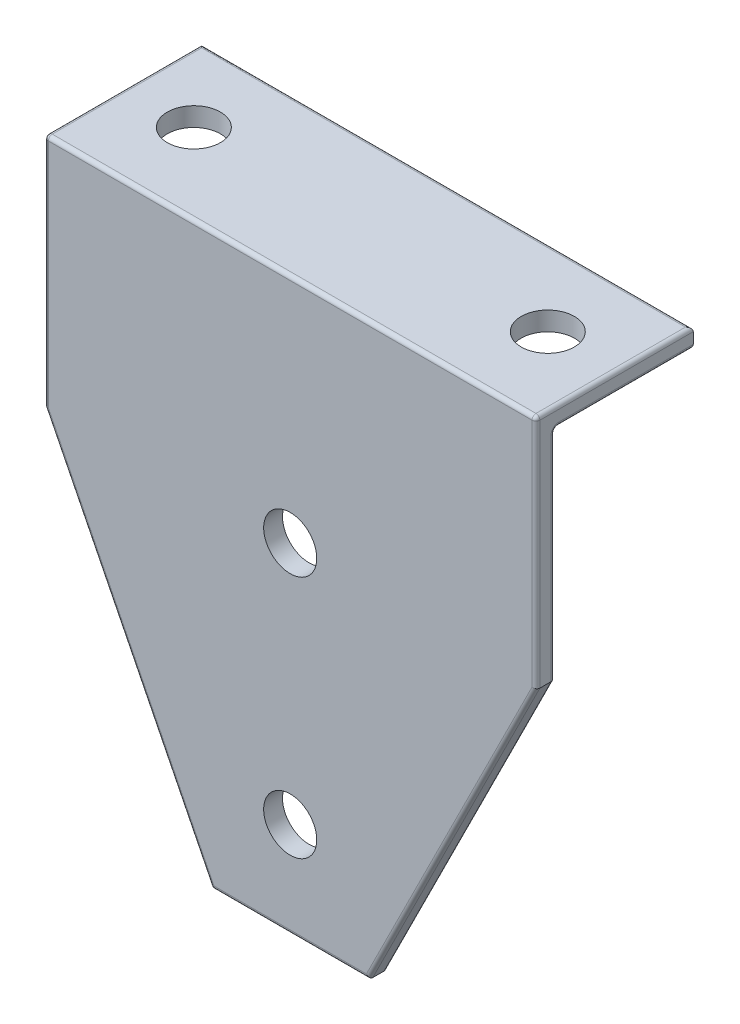
ISO-10303-21;
HEADER;
FILE_DESCRIPTION(('STEP AP214'),'2;1');
FILE_NAME('part.step','',(''),(''),'','','');
FILE_SCHEMA(('AUTOMOTIVE_DESIGN { 1 0 10303 214 1 1 1 1 }'));
ENDSEC;
DATA;
#1=APPLICATION_CONTEXT('core data for automotive mechanical design processes');
#2=APPLICATION_PROTOCOL_DEFINITION('international standard','automotive_design',2000,#1);
#3=PRODUCT_CONTEXT('',#1,'mechanical');
#4=PRODUCT('Part','Part','',(#3));
#5=PRODUCT_RELATED_PRODUCT_CATEGORY('part','',(#4));
#6=PRODUCT_DEFINITION_FORMATION('','',#4);
#7=PRODUCT_DEFINITION_CONTEXT('part definition',#1,'design');
#8=PRODUCT_DEFINITION('design','',#6,#7);
#9=PRODUCT_DEFINITION_SHAPE('','',#8);
#10=(LENGTH_UNIT() NAMED_UNIT(*) SI_UNIT(.MILLI.,.METRE.));
#11=(NAMED_UNIT(*) PLANE_ANGLE_UNIT() SI_UNIT($,.RADIAN.));
#12=(NAMED_UNIT(*) SI_UNIT($,.STERADIAN.) SOLID_ANGLE_UNIT());
#13=UNCERTAINTY_MEASURE_WITH_UNIT(LENGTH_MEASURE(1.E-05),#10,'distance_accuracy_value','');
#14=(GEOMETRIC_REPRESENTATION_CONTEXT(3) GLOBAL_UNCERTAINTY_ASSIGNED_CONTEXT((#13)) GLOBAL_UNIT_ASSIGNED_CONTEXT((#10,
#11,#12)) REPRESENTATION_CONTEXT('',''));
#15=CARTESIAN_POINT('',(0.,0.,0.));
#16=DIRECTION('',(0.,0.,1.));
#17=DIRECTION('',(1.,0.,0.));
#18=AXIS2_PLACEMENT_3D('',#15,#16,#17);
#19=CARTESIAN_POINT('',(-830.,-208.600000000002,-4.8));
#20=DIRECTION('',(0.894427190999915,-0.447213595499959,0.));
#21=DIRECTION('',(0.447213595499959,0.894427190999916,0.));
#22=AXIS2_PLACEMENT_3D('',#19,#20,#21);
#23=PLANE('',#22);
#24=DIRECTION('',(0.,0.,1.));
#25=VECTOR('',#24,1.);
#26=CARTESIAN_POINT('',(-787.5,-123.600000000001,-4.8));
#27=LINE('',#26,#25);
#28=CARTESIAN_POINT('',(-787.5,-123.600000000001,-3.8));
#29=VERTEX_POINT('',#28);
#30=CARTESIAN_POINT('',(-787.5,-123.600000000001,-1.));
#31=VERTEX_POINT('',#30);
#32=EDGE_CURVE('E355',#29,#31,#27,.T.);
#33=ORIENTED_EDGE('',*,*,#32,.T.);
#34=DIRECTION('',(0.447213595499959,0.894427190999916,0.));
#35=VECTOR('',#34,1.);
#36=CARTESIAN_POINT('',(-830.,-208.600000000002,-1.));
#37=LINE('',#36,#35);
#38=CARTESIAN_POINT('',(-830.,-208.600000000002,-1.));
#39=VERTEX_POINT('',#38);
#40=EDGE_CURVE('E271',#31,#39,#37,.F.);
#41=ORIENTED_EDGE('',*,*,#40,.T.);
#42=DIRECTION('',(0.,0.,1.));
#43=VECTOR('',#42,1.);
#44=CARTESIAN_POINT('',(-830.,-208.600000000002,-4.8));
#45=LINE('',#44,#43);
#46=CARTESIAN_POINT('',(-830.,-208.600000000002,-3.8));
#47=VERTEX_POINT('',#46);
#48=EDGE_CURVE('E204',#47,#39,#45,.T.);
#49=ORIENTED_EDGE('',*,*,#48,.F.);
#50=DIRECTION('',(0.447213595499959,0.894427190999916,0.));
#51=VECTOR('',#50,1.);
#52=CARTESIAN_POINT('',(-830.,-208.600000000002,-3.8));
#53=LINE('',#52,#51);
#54=EDGE_CURVE('E269',#47,#29,#53,.T.);
#55=ORIENTED_EDGE('',*,*,#54,.T.);
#56=EDGE_LOOP('',(#33,#41,#49,#55));
#57=FACE_BOUND('',#56,.T.);
#58=ADVANCED_FACE('F43',(#57),#23,.T.);
#59=CARTESIAN_POINT('',(-870.,-208.600000000002,-4.8));
#60=DIRECTION('',(0.,-1.,0.));
#61=DIRECTION('',(0.,0.,-1.));
#62=AXIS2_PLACEMENT_3D('',#59,#60,#61);
#63=PLANE('',#62);
#64=ORIENTED_EDGE('',*,*,#48,.T.);
#65=DIRECTION('',(1.,0.,0.));
#66=VECTOR('',#65,1.);
#67=CARTESIAN_POINT('',(-870.,-208.600000000002,-1.));
#68=LINE('',#67,#66);
#69=CARTESIAN_POINT('',(-870.,-208.600000000002,-1.));
#70=VERTEX_POINT('',#69);
#71=EDGE_CURVE('E263',#39,#70,#68,.F.);
#72=ORIENTED_EDGE('',*,*,#71,.T.);
#73=DIRECTION('',(0.,0.,1.));
#74=VECTOR('',#73,1.);
#75=CARTESIAN_POINT('',(-870.,-208.600000000002,-4.8));
#76=LINE('',#75,#74);
#77=CARTESIAN_POINT('',(-870.,-208.600000000002,-3.8));
#78=VERTEX_POINT('',#77);
#79=EDGE_CURVE('E358',#78,#70,#76,.T.);
#80=ORIENTED_EDGE('',*,*,#79,.F.);
#81=DIRECTION('',(1.,0.,0.));
#82=VECTOR('',#81,1.);
#83=CARTESIAN_POINT('',(-870.,-208.600000000002,-3.8));
#84=LINE('',#83,#82);
#85=EDGE_CURVE('E261',#78,#47,#84,.T.);
#86=ORIENTED_EDGE('',*,*,#85,.T.);
#87=EDGE_LOOP('',(#64,#72,#80,#86));
#88=FACE_BOUND('',#87,.T.);
#89=ADVANCED_FACE('F441',(#88),#63,.T.);
#90=CARTESIAN_POINT('',(-912.5,-123.600000000001,-4.8));
#91=DIRECTION('',(-0.894427190999915,-0.447213595499959,0.));
#92=DIRECTION('',(0.447213595499959,-0.894427190999916,0.));
#93=AXIS2_PLACEMENT_3D('',#90,#91,#92);
#94=PLANE('',#93);
#95=ORIENTED_EDGE('',*,*,#79,.T.);
#96=DIRECTION('',(0.447213595499959,-0.894427190999916,0.));
#97=VECTOR('',#96,1.);
#98=CARTESIAN_POINT('',(-912.5,-123.600000000001,-1.));
#99=LINE('',#98,#97);
#100=CARTESIAN_POINT('',(-912.5,-123.600000000001,-1.));
#101=VERTEX_POINT('',#100);
#102=EDGE_CURVE('E267',#70,#101,#99,.F.);
#103=ORIENTED_EDGE('',*,*,#102,.T.);
#104=DIRECTION('',(0.,0.,1.));
#105=VECTOR('',#104,1.);
#106=CARTESIAN_POINT('',(-912.5,-123.600000000001,-4.8));
#107=LINE('',#106,#105);
#108=CARTESIAN_POINT('',(-912.5,-123.600000000001,-3.8));
#109=VERTEX_POINT('',#108);
#110=EDGE_CURVE('E361',#109,#101,#107,.T.);
#111=ORIENTED_EDGE('',*,*,#110,.F.);
#112=DIRECTION('',(0.447213595499959,-0.894427190999916,0.));
#113=VECTOR('',#112,1.);
#114=CARTESIAN_POINT('',(-912.5,-123.600000000001,-3.8));
#115=LINE('',#114,#113);
#116=EDGE_CURVE('E265',#109,#78,#115,.T.);
#117=ORIENTED_EDGE('',*,*,#116,.T.);
#118=EDGE_LOOP('',(#95,#103,#111,#117));
#119=FACE_BOUND('',#118,.T.);
#120=ADVANCED_FACE('F467',(#119),#94,.T.);
#121=CARTESIAN_POINT('',(-912.5,-63.6000000000015,-4.8));
#122=DIRECTION('',(-1.,0.,0.));
#123=DIRECTION('',(0.,-1.,0.));
#124=AXIS2_PLACEMENT_3D('',#121,#122,#123);
#125=PLANE('',#124);
#126=DIRECTION('',(0.,-1.,0.));
#127=VECTOR('',#126,1.);
#128=CARTESIAN_POINT('',(-912.5,-63.6000000000015,-1.));
#129=LINE('',#128,#127);
#130=CARTESIAN_POINT('',(-912.5,-64.6000000000015,-1.));
#131=VERTEX_POINT('',#130);
#132=EDGE_CURVE('E234',#101,#131,#129,.F.);
#133=ORIENTED_EDGE('',*,*,#132,.T.);
#134=DIRECTION('',(0.,0.,1.));
#135=VECTOR('',#134,1.);
#136=CARTESIAN_POINT('',(-912.5,-64.6000000000015,-4.8));
#137=LINE('',#136,#135);
#138=CARTESIAN_POINT('',(-912.5,-64.6000000000015,-40.));
#139=VERTEX_POINT('',#138);
#140=EDGE_CURVE('E236',#131,#139,#137,.F.);
#141=ORIENTED_EDGE('',*,*,#140,.T.);
#142=DIRECTION('',(0.,1.,0.));
#143=VECTOR('',#142,1.);
#144=CARTESIAN_POINT('',(-912.5,-63.6000000000015,-40.));
#145=LINE('',#144,#143);
#146=CARTESIAN_POINT('',(-912.5,-67.4000000000015,-40.));
#147=VERTEX_POINT('',#146);
#148=EDGE_CURVE('E352',#147,#139,#145,.T.);
#149=ORIENTED_EDGE('',*,*,#148,.F.);
#150=DIRECTION('',(0.,0.,1.));
#151=VECTOR('',#150,1.);
#152=CARTESIAN_POINT('',(-912.5,-67.4000000000015,-4.8));
#153=LINE('',#152,#151);
#154=CARTESIAN_POINT('',(-912.5,-67.4000000000015,-5.8));
#155=VERTEX_POINT('',#154);
#156=EDGE_CURVE('E232',#147,#155,#153,.T.);
#157=ORIENTED_EDGE('',*,*,#156,.T.);
#158=CARTESIAN_POINT('',(-912.5,-69.4000000000015,-5.8));
#159=DIRECTION('',(-1.,0.,0.));
#160=DIRECTION('',(0.,-1.,0.));
#161=AXIS2_PLACEMENT_3D('',#158,#159,#160);
#162=CIRCLE('',#161,2.);
#163=CARTESIAN_POINT('',(-912.5,-69.4000000000015,-3.8));
#164=VERTEX_POINT('',#163);
#165=EDGE_CURVE('E229',#164,#155,#162,.T.);
#166=ORIENTED_EDGE('',*,*,#165,.F.);
#167=DIRECTION('',(0.,-1.,0.));
#168=VECTOR('',#167,1.);
#169=CARTESIAN_POINT('',(-912.5,-63.6000000000015,-3.8));
#170=LINE('',#169,#168);
#171=EDGE_CURVE('E227',#164,#109,#170,.T.);
#172=ORIENTED_EDGE('',*,*,#171,.T.);
#173=ORIENTED_EDGE('',*,*,#110,.T.);
#174=EDGE_LOOP('',(#133,#141,#149,#157,#166,#172,#173));
#175=FACE_BOUND('',#174,.T.);
#176=ADVANCED_FACE('F389',(#175),#125,.T.);
#177=CARTESIAN_POINT('',(-912.5,-63.6000000000015,-4.8));
#178=DIRECTION('',(0.,1.,0.));
#179=DIRECTION('',(-1.,0.,0.));
#180=AXIS2_PLACEMENT_3D('',#177,#178,#179);
#181=PLANE('',#180);
#182=CARTESIAN_POINT('',(-895.,-63.6000000000015,-20.5));
#183=DIRECTION('',(0.,1.,0.));
#184=DIRECTION('',(0.,0.,1.));
#185=AXIS2_PLACEMENT_3D('',#182,#183,#184);
#186=CIRCLE('',#185,6.75000000000003);
#187=CARTESIAN_POINT('',(-895.,-63.6000000000015,-13.75));
#188=VERTEX_POINT('',#187);
#189=EDGE_CURVE('E346',#188,#188,#186,.T.);
#190=ORIENTED_EDGE('',*,*,#189,.F.);
#191=EDGE_LOOP('',(#190));
#192=FACE_BOUND('',#191,.T.);
#193=CARTESIAN_POINT('',(-805.,-63.6000000000015,-20.5));
#194=DIRECTION('',(0.,1.,0.));
#195=DIRECTION('',(0.,0.,1.));
#196=AXIS2_PLACEMENT_3D('',#193,#194,#195);
#197=CIRCLE('',#196,6.75000000000003);
#198=CARTESIAN_POINT('',(-805.,-63.6000000000015,-13.75));
#199=VERTEX_POINT('',#198);
#200=EDGE_CURVE('E338',#199,#199,#197,.T.);
#201=ORIENTED_EDGE('',*,*,#200,.F.);
#202=EDGE_LOOP('',(#201));
#203=FACE_BOUND('',#202,.T.);
#204=DIRECTION('',(1.,0.,0.));
#205=VECTOR('',#204,1.);
#206=CARTESIAN_POINT('',(-912.5,-63.6000000000015,-39.));
#207=LINE('',#206,#205);
#208=CARTESIAN_POINT('',(-788.5,-63.6000000000015,-39.));
#209=VERTEX_POINT('',#208);
#210=CARTESIAN_POINT('',(-911.5,-63.6000000000015,-39.));
#211=VERTEX_POINT('',#210);
#212=EDGE_CURVE('E243',#209,#211,#207,.F.);
#213=ORIENTED_EDGE('',*,*,#212,.T.);
#214=DIRECTION('',(0.,0.,1.));
#215=VECTOR('',#214,1.);
#216=CARTESIAN_POINT('',(-911.5,-63.6000000000015,-4.8));
#217=LINE('',#216,#215);
#218=CARTESIAN_POINT('',(-911.5,-63.6000000000015,-1.));
#219=VERTEX_POINT('',#218);
#220=EDGE_CURVE('E245',#211,#219,#217,.T.);
#221=ORIENTED_EDGE('',*,*,#220,.T.);
#222=DIRECTION('',(-1.,0.,0.));
#223=VECTOR('',#222,1.);
#224=CARTESIAN_POINT('',(-787.5,-63.6000000000015,-1.));
#225=LINE('',#224,#223);
#226=CARTESIAN_POINT('',(-788.5,-63.6000000000015,-1.));
#227=VERTEX_POINT('',#226);
#228=EDGE_CURVE('E239',#219,#227,#225,.F.);
#229=ORIENTED_EDGE('',*,*,#228,.T.);
#230=DIRECTION('',(0.,0.,1.));
#231=VECTOR('',#230,1.);
#232=CARTESIAN_POINT('',(-788.5,-63.6000000000015,-4.8));
#233=LINE('',#232,#231);
#234=EDGE_CURVE('E241',#227,#209,#233,.F.);
#235=ORIENTED_EDGE('',*,*,#234,.T.);
#236=EDGE_LOOP('',(#213,#221,#229,#235));
#237=FACE_BOUND('',#236,.T.);
#238=ADVANCED_FACE('F405',(#192,#203,#237),#181,.T.);
#239=CARTESIAN_POINT('',(-787.5,-63.6000000000015,-4.8));
#240=DIRECTION('',(1.,0.,0.));
#241=DIRECTION('',(0.,1.,0.));
#242=AXIS2_PLACEMENT_3D('',#239,#240,#241);
#243=PLANE('',#242);
#244=DIRECTION('',(0.,-1.,0.));
#245=VECTOR('',#244,1.);
#246=CARTESIAN_POINT('',(-787.5,-63.6000000000015,-40.));
#247=LINE('',#246,#245);
#248=CARTESIAN_POINT('',(-787.5,-64.6000000000015,-40.));
#249=VERTEX_POINT('',#248);
#250=CARTESIAN_POINT('',(-787.5,-67.4000000000015,-40.));
#251=VERTEX_POINT('',#250);
#252=EDGE_CURVE('E304',#249,#251,#247,.T.);
#253=ORIENTED_EDGE('',*,*,#252,.F.);
#254=DIRECTION('',(0.,0.,1.));
#255=VECTOR('',#254,1.);
#256=CARTESIAN_POINT('',(-787.5,-64.6000000000015,-4.8));
#257=LINE('',#256,#255);
#258=CARTESIAN_POINT('',(-787.5,-64.6000000000015,-1.));
#259=VERTEX_POINT('',#258);
#260=EDGE_CURVE('E221',#249,#259,#257,.T.);
#261=ORIENTED_EDGE('',*,*,#260,.T.);
#262=DIRECTION('',(0.,1.,0.));
#263=VECTOR('',#262,1.);
#264=CARTESIAN_POINT('',(-787.5,-123.600000000001,-1.));
#265=LINE('',#264,#263);
#266=EDGE_CURVE('E219',#259,#31,#265,.F.);
#267=ORIENTED_EDGE('',*,*,#266,.T.);
#268=ORIENTED_EDGE('',*,*,#32,.F.);
#269=DIRECTION('',(0.,1.,0.));
#270=VECTOR('',#269,1.);
#271=CARTESIAN_POINT('',(-787.5,-63.6000000000015,-3.8));
#272=LINE('',#271,#270);
#273=CARTESIAN_POINT('',(-787.5,-69.4000000000015,-3.8));
#274=VERTEX_POINT('',#273);
#275=EDGE_CURVE('E212',#29,#274,#272,.T.);
#276=ORIENTED_EDGE('',*,*,#275,.T.);
#277=CARTESIAN_POINT('',(-787.5,-69.4000000000015,-5.8));
#278=DIRECTION('',(1.,0.,0.));
#279=DIRECTION('',(0.,1.,0.));
#280=AXIS2_PLACEMENT_3D('',#277,#278,#279);
#281=CIRCLE('',#280,2.);
#282=CARTESIAN_POINT('',(-787.5,-67.4000000000015,-5.8));
#283=VERTEX_POINT('',#282);
#284=EDGE_CURVE('E210',#283,#274,#281,.T.);
#285=ORIENTED_EDGE('',*,*,#284,.F.);
#286=DIRECTION('',(0.,0.,1.));
#287=VECTOR('',#286,1.);
#288=CARTESIAN_POINT('',(-787.5,-67.4000000000015,-40.));
#289=LINE('',#288,#287);
#290=EDGE_CURVE('E180',#283,#251,#289,.F.);
#291=ORIENTED_EDGE('',*,*,#290,.T.);
#292=EDGE_LOOP('',(#253,#261,#267,#268,#276,#285,#291));
#293=FACE_BOUND('',#292,.T.);
#294=ADVANCED_FACE('F377',(#293),#243,.T.);
#295=CARTESIAN_POINT('',(0.,0.,-4.8));
#296=DIRECTION('',(0.,0.,-1.));
#297=DIRECTION('',(-1.,0.,0.));
#298=AXIS2_PLACEMENT_3D('',#295,#296,#297);
#299=PLANE('',#298);
#300=CARTESIAN_POINT('',(-850.,-122.400000000045,-4.8));
#301=DIRECTION('',(0.,0.,-1.));
#302=DIRECTION('',(-1.,0.,0.));
#303=AXIS2_PLACEMENT_3D('',#300,#301,#302);
#304=CIRCLE('',#303,6.75000000000003);
#305=CARTESIAN_POINT('',(-856.75,-122.400000000045,-4.8));
#306=VERTEX_POINT('',#305);
#307=EDGE_CURVE('E779',#306,#306,#304,.T.);
#308=ORIENTED_EDGE('',*,*,#307,.F.);
#309=EDGE_LOOP('',(#308));
#310=FACE_BOUND('',#309,.T.);
#311=CARTESIAN_POINT('',(-850.,-184.400000000047,-4.8));
#312=DIRECTION('',(0.,0.,-1.));
#313=DIRECTION('',(-1.,0.,0.));
#314=AXIS2_PLACEMENT_3D('',#311,#312,#313);
#315=CIRCLE('',#314,6.75000000000003);
#316=CARTESIAN_POINT('',(-856.75,-184.400000000047,-4.8));
#317=VERTEX_POINT('',#316);
#318=EDGE_CURVE('E788',#317,#317,#315,.T.);
#319=ORIENTED_EDGE('',*,*,#318,.F.);
#320=EDGE_LOOP('',(#319));
#321=FACE_BOUND('',#320,.T.);
#322=DIRECTION('',(0.447213595499959,-0.894427190999916,0.));
#323=VECTOR('',#322,1.);
#324=CARTESIAN_POINT('',(-778.545572809,-389.272786404501,-4.8));
#325=LINE('',#324,#323);
#326=CARTESIAN_POINT('',(-869.38196601125,-207.600000000002,-4.8));
#327=VERTEX_POINT('',#326);
#328=CARTESIAN_POINT('',(-911.5,-123.363932022502,-4.8));
#329=VERTEX_POINT('',#328);
#330=EDGE_CURVE('E52',#327,#329,#325,.F.);
#331=ORIENTED_EDGE('',*,*,#330,.T.);
#332=DIRECTION('',(0.,-1.,0.));
#333=VECTOR('',#332,1.);
#334=CARTESIAN_POINT('',(-911.5,1.68661381157638E-12,-4.8));
#335=LINE('',#334,#333);
#336=CARTESIAN_POINT('',(-911.5,-69.4000000000015,-4.8));
#337=VERTEX_POINT('',#336);
#338=EDGE_CURVE('E11',#329,#337,#335,.F.);
#339=ORIENTED_EDGE('',*,*,#338,.T.);
#340=DIRECTION('',(-1.,0.,0.));
#341=VECTOR('',#340,1.);
#342=CARTESIAN_POINT('',(0.,-69.4000000000015,-4.8));
#343=LINE('',#342,#341);
#344=CARTESIAN_POINT('',(-788.5,-69.4000000000015,-4.8));
#345=VERTEX_POINT('',#344);
#346=EDGE_CURVE('E273',#337,#345,#343,.F.);
#347=ORIENTED_EDGE('',*,*,#346,.T.);
#348=DIRECTION('',(0.,1.,0.));
#349=VECTOR('',#348,1.);
#350=CARTESIAN_POINT('',(-788.5,-1.45901809152823E-12,-4.8));
#351=LINE('',#350,#349);
#352=CARTESIAN_POINT('',(-788.5,-123.363932022502,-4.8));
#353=VERTEX_POINT('',#352);
#354=EDGE_CURVE('E275',#345,#353,#351,.F.);
#355=ORIENTED_EDGE('',*,*,#354,.T.);
#356=DIRECTION('',(0.447213595499959,0.894427190999916,0.));
#357=VECTOR('',#356,1.);
#358=CARTESIAN_POINT('',(-581.454427190999,290.7272135955,-4.8));
#359=LINE('',#358,#357);
#360=CARTESIAN_POINT('',(-830.61803398875,-207.600000000002,-4.8));
#361=VERTEX_POINT('',#360);
#362=EDGE_CURVE('E277',#353,#361,#359,.F.);
#363=ORIENTED_EDGE('',*,*,#362,.T.);
#364=DIRECTION('',(1.,0.,0.));
#365=VECTOR('',#364,1.);
#366=CARTESIAN_POINT('',(0.,-207.600000000002,-4.8));
#367=LINE('',#366,#365);
#368=EDGE_CURVE('E63',#361,#327,#367,.F.);
#369=ORIENTED_EDGE('',*,*,#368,.T.);
#370=EDGE_LOOP('',(#331,#339,#347,#355,#363,#369));
#371=FACE_BOUND('',#370,.T.);
#372=ADVANCED_FACE('F456',(#310,#321,#371),#299,.T.);
#373=CARTESIAN_POINT('',(0.,0.,0.));
#374=DIRECTION('',(0.,0.,-1.));
#375=DIRECTION('',(-1.,0.,0.));
#376=AXIS2_PLACEMENT_3D('',#373,#374,#375);
#377=PLANE('',#376);
#378=CARTESIAN_POINT('',(-850.,-122.400000000045,0.));
#379=DIRECTION('',(0.,0.,1.));
#380=DIRECTION('',(1.,0.,0.));
#381=AXIS2_PLACEMENT_3D('',#378,#379,#380);
#382=CIRCLE('',#381,6.75000000000003);
#383=CARTESIAN_POINT('',(-843.25,-122.400000000045,0.));
#384=VERTEX_POINT('',#383);
#385=EDGE_CURVE('E782',#384,#384,#382,.T.);
#386=ORIENTED_EDGE('',*,*,#385,.F.);
#387=EDGE_LOOP('',(#386));
#388=FACE_BOUND('',#387,.T.);
#389=CARTESIAN_POINT('',(-850.,-184.400000000047,0.));
#390=DIRECTION('',(0.,0.,1.));
#391=DIRECTION('',(1.,0.,0.));
#392=AXIS2_PLACEMENT_3D('',#389,#390,#391);
#393=CIRCLE('',#392,6.75000000000003);
#394=CARTESIAN_POINT('',(-843.25,-184.400000000047,0.));
#395=VERTEX_POINT('',#394);
#396=EDGE_CURVE('E784',#395,#395,#393,.T.);
#397=ORIENTED_EDGE('',*,*,#396,.F.);
#398=EDGE_LOOP('',(#397));
#399=FACE_BOUND('',#398,.T.);
#400=DIRECTION('',(0.447213595499959,-0.894427190999916,0.));
#401=VECTOR('',#400,1.);
#402=CARTESIAN_POINT('',(-869.105572809,-208.152786404501,0.));
#403=LINE('',#402,#401);
#404=CARTESIAN_POINT('',(-911.5,-123.363932022502,0.));
#405=VERTEX_POINT('',#404);
#406=CARTESIAN_POINT('',(-869.38196601125,-207.600000000001,0.));
#407=VERTEX_POINT('',#406);
#408=EDGE_CURVE('E256',#405,#407,#403,.T.);
#409=ORIENTED_EDGE('',*,*,#408,.T.);
#410=DIRECTION('',(1.,0.,0.));
#411=VECTOR('',#410,1.);
#412=CARTESIAN_POINT('',(-830.,-207.600000000002,0.));
#413=LINE('',#412,#411);
#414=CARTESIAN_POINT('',(-830.61803398875,-207.600000000002,0.));
#415=VERTEX_POINT('',#414);
#416=EDGE_CURVE('E258',#407,#415,#413,.T.);
#417=ORIENTED_EDGE('',*,*,#416,.T.);
#418=DIRECTION('',(0.447213595499959,0.894427190999916,0.));
#419=VECTOR('',#418,1.);
#420=CARTESIAN_POINT('',(-788.394427191,-123.152786404502,0.));
#421=LINE('',#420,#419);
#422=CARTESIAN_POINT('',(-788.5,-123.363932022502,0.));
#423=VERTEX_POINT('',#422);
#424=EDGE_CURVE('E248',#415,#423,#421,.T.);
#425=ORIENTED_EDGE('',*,*,#424,.T.);
#426=DIRECTION('',(0.,1.,0.));
#427=VECTOR('',#426,1.);
#428=CARTESIAN_POINT('',(-788.5,-63.6000000000015,0.));
#429=LINE('',#428,#427);
#430=CARTESIAN_POINT('',(-788.5,-64.6000000000015,0.));
#431=VERTEX_POINT('',#430);
#432=EDGE_CURVE('E250',#423,#431,#429,.T.);
#433=ORIENTED_EDGE('',*,*,#432,.T.);
#434=DIRECTION('',(-1.,0.,0.));
#435=VECTOR('',#434,1.);
#436=CARTESIAN_POINT('',(-912.5,-64.6000000000015,0.));
#437=LINE('',#436,#435);
#438=CARTESIAN_POINT('',(-911.5,-64.6000000000015,0.));
#439=VERTEX_POINT('',#438);
#440=EDGE_CURVE('E252',#431,#439,#437,.T.);
#441=ORIENTED_EDGE('',*,*,#440,.T.);
#442=DIRECTION('',(0.,-1.,0.));
#443=VECTOR('',#442,1.);
#444=CARTESIAN_POINT('',(-911.5,-123.600000000001,0.));
#445=LINE('',#444,#443);
#446=EDGE_CURVE('E254',#439,#405,#445,.T.);
#447=ORIENTED_EDGE('',*,*,#446,.T.);
#448=EDGE_LOOP('',(#409,#417,#425,#433,#441,#447));
#449=FACE_BOUND('',#448,.T.);
#450=ADVANCED_FACE('F420',(#388,#399,#449),#377,.F.);
#451=CARTESIAN_POINT('',(-787.5,-68.4000000000015,-40.));
#452=DIRECTION('',(0.,1.,0.));
#453=DIRECTION('',(0.,0.,1.));
#454=AXIS2_PLACEMENT_3D('',#451,#452,#453);
#455=PLANE('',#454);
#456=CARTESIAN_POINT('',(-895.,-68.4000000000015,-20.5));
#457=DIRECTION('',(0.,1.,0.));
#458=DIRECTION('',(0.,0.,1.));
#459=AXIS2_PLACEMENT_3D('',#456,#457,#458);
#460=CIRCLE('',#459,6.74999999999998);
#461=CARTESIAN_POINT('',(-895.,-68.4000000000015,-13.75));
#462=VERTEX_POINT('',#461);
#463=EDGE_CURVE('E47',#462,#462,#460,.T.);
#464=ORIENTED_EDGE('',*,*,#463,.T.);
#465=EDGE_LOOP('',(#464));
#466=FACE_BOUND('',#465,.T.);
#467=CARTESIAN_POINT('',(-805.,-68.4000000000015,-20.5));
#468=DIRECTION('',(0.,1.,0.));
#469=DIRECTION('',(0.,0.,1.));
#470=AXIS2_PLACEMENT_3D('',#467,#468,#469);
#471=CIRCLE('',#470,6.74999999999998);
#472=CARTESIAN_POINT('',(-805.,-68.4000000000015,-13.75));
#473=VERTEX_POINT('',#472);
#474=EDGE_CURVE('E308',#473,#473,#471,.T.);
#475=ORIENTED_EDGE('',*,*,#474,.T.);
#476=EDGE_LOOP('',(#475));
#477=FACE_BOUND('',#476,.T.);
#478=DIRECTION('',(-1.,0.,0.));
#479=VECTOR('',#478,1.);
#480=CARTESIAN_POINT('',(-787.5,-68.4000000000015,-39.));
#481=LINE('',#480,#479);
#482=CARTESIAN_POINT('',(-911.5,-68.4000000000015,-39.));
#483=VERTEX_POINT('',#482);
#484=CARTESIAN_POINT('',(-788.5,-68.4000000000015,-39.));
#485=VERTEX_POINT('',#484);
#486=EDGE_CURVE('E208',#483,#485,#481,.F.);
#487=ORIENTED_EDGE('',*,*,#486,.T.);
#488=DIRECTION('',(0.,0.,1.));
#489=VECTOR('',#488,1.);
#490=CARTESIAN_POINT('',(-788.5,-68.4000000000015,-4.8));
#491=LINE('',#490,#489);
#492=CARTESIAN_POINT('',(-788.5,-68.4000000000015,-5.8));
#493=VERTEX_POINT('',#492);
#494=EDGE_CURVE('E178',#485,#493,#491,.T.);
#495=ORIENTED_EDGE('',*,*,#494,.T.);
#496=DIRECTION('',(-1.,0.,0.));
#497=VECTOR('',#496,1.);
#498=CARTESIAN_POINT('',(-787.5,-68.4000000000015,-5.8));
#499=LINE('',#498,#497);
#500=CARTESIAN_POINT('',(-911.5,-68.4000000000015,-5.8));
#501=VERTEX_POINT('',#500);
#502=EDGE_CURVE('E197',#493,#501,#499,.T.);
#503=ORIENTED_EDGE('',*,*,#502,.T.);
#504=DIRECTION('',(0.,0.,1.));
#505=VECTOR('',#504,1.);
#506=CARTESIAN_POINT('',(-911.5,-68.4000000000015,-40.));
#507=LINE('',#506,#505);
#508=EDGE_CURVE('E203',#501,#483,#507,.F.);
#509=ORIENTED_EDGE('',*,*,#508,.T.);
#510=EDGE_LOOP('',(#487,#495,#503,#509));
#511=FACE_BOUND('',#510,.T.);
#512=ADVANCED_FACE('F206',(#466,#477,#511),#455,.F.);
#513=CARTESIAN_POINT('',(0.,0.,-40.));
#514=DIRECTION('',(0.,0.,-1.));
#515=DIRECTION('',(-1.,0.,0.));
#516=AXIS2_PLACEMENT_3D('',#513,#514,#515);
#517=PLANE('',#516);
#518=ORIENTED_EDGE('',*,*,#252,.T.);
#519=DIRECTION('',(-1.,0.,0.));
#520=VECTOR('',#519,1.);
#521=CARTESIAN_POINT('',(-912.5,-67.4000000000015,-40.));
#522=LINE('',#521,#520);
#523=EDGE_CURVE('E225',#251,#147,#522,.T.);
#524=ORIENTED_EDGE('',*,*,#523,.T.);
#525=ORIENTED_EDGE('',*,*,#148,.T.);
#526=DIRECTION('',(1.,0.,0.));
#527=VECTOR('',#526,1.);
#528=CARTESIAN_POINT('',(0.,-64.6000000000014,-40.));
#529=LINE('',#528,#527);
#530=EDGE_CURVE('E223',#139,#249,#529,.T.);
#531=ORIENTED_EDGE('',*,*,#530,.T.);
#532=EDGE_LOOP('',(#518,#524,#525,#531));
#533=FACE_BOUND('',#532,.T.);
#534=ADVANCED_FACE('F379',(#533),#517,.T.);
#535=CARTESIAN_POINT('',(-911.605572809,-123.152786404502,-3.8));
#536=DIRECTION('',(0.447213595499959,-0.894427190999916,0.));
#537=DIRECTION('',(0.894427190999916,0.447213595499959,0.));
#538=AXIS2_PLACEMENT_3D('',#535,#536,#537);
#539=CYLINDRICAL_SURFACE('',#538,1.);
#540=CARTESIAN_POINT('',(-869.38196601125,-207.600000000002,-3.8));
#541=DIRECTION('',(0.85065080835204,-0.525731112119133,0.));
#542=DIRECTION('',(0.525731112119133,0.85065080835204,0.));
#543=AXIS2_PLACEMENT_3D('',#540,#541,#542);
#544=ELLIPSE('',#543,1.17557050458495,1.);
#545=EDGE_CURVE('E298',#78,#327,#544,.T.);
#546=ORIENTED_EDGE('',*,*,#545,.F.);
#547=ORIENTED_EDGE('',*,*,#116,.F.);
#548=CARTESIAN_POINT('',(-911.5,-123.363932022502,-3.8));
#549=DIRECTION('',(0.229752920547361,-0.97324898946773,0.));
#550=DIRECTION('',(0.97324898946773,0.22975292054736,0.));
#551=AXIS2_PLACEMENT_3D('',#548,#549,#550);
#552=ELLIPSE('',#551,1.02748629674602,1.);
#553=EDGE_CURVE('E301',#329,#109,#552,.F.);
#554=ORIENTED_EDGE('',*,*,#553,.F.);
#555=ORIENTED_EDGE('',*,*,#330,.F.);
#556=EDGE_LOOP('',(#546,#547,#554,#555));
#557=FACE_BOUND('',#556,.T.);
#558=ADVANCED_FACE('F469',(#557),#539,.T.);
#559=CARTESIAN_POINT('',(-911.5,-63.6000000000015,-3.8));
#560=DIRECTION('',(0.,-1.,0.));
#561=DIRECTION('',(1.,0.,0.));
#562=AXIS2_PLACEMENT_3D('',#559,#560,#561);
#563=CYLINDRICAL_SURFACE('',#562,1.);
#564=ORIENTED_EDGE('',*,*,#553,.T.);
#565=ORIENTED_EDGE('',*,*,#171,.F.);
#566=CARTESIAN_POINT('',(-911.5,-69.4000000000015,-3.8));
#567=DIRECTION('',(0.,1.,0.));
#568=DIRECTION('',(0.,0.,1.));
#569=AXIS2_PLACEMENT_3D('',#566,#567,#568);
#570=CIRCLE('',#569,1.);
#571=EDGE_CURVE('E295',#337,#164,#570,.T.);
#572=ORIENTED_EDGE('',*,*,#571,.F.);
#573=ORIENTED_EDGE('',*,*,#338,.F.);
#574=EDGE_LOOP('',(#564,#565,#572,#573));
#575=FACE_BOUND('',#574,.T.);
#576=ADVANCED_FACE('F463',(#575),#563,.T.);
#577=CARTESIAN_POINT('',(-870.,-207.600000000002,-3.8));
#578=DIRECTION('',(1.,0.,0.));
#579=DIRECTION('',(0.,0.,-1.));
#580=AXIS2_PLACEMENT_3D('',#577,#578,#579);
#581=CYLINDRICAL_SURFACE('',#580,1.);
#582=ORIENTED_EDGE('',*,*,#545,.T.);
#583=ORIENTED_EDGE('',*,*,#368,.F.);
#584=CARTESIAN_POINT('',(-830.61803398875,-207.600000000002,-3.8));
#585=DIRECTION('',(0.85065080835204,0.525731112119133,0.));
#586=DIRECTION('',(-0.525731112119133,0.85065080835204,0.));
#587=AXIS2_PLACEMENT_3D('',#584,#585,#586);
#588=ELLIPSE('',#587,1.17557050458495,1.);
#589=EDGE_CURVE('E292',#47,#361,#588,.T.);
#590=ORIENTED_EDGE('',*,*,#589,.F.);
#591=ORIENTED_EDGE('',*,*,#85,.F.);
#592=EDGE_LOOP('',(#582,#583,#590,#591));
#593=FACE_BOUND('',#592,.T.);
#594=ADVANCED_FACE('F446',(#593),#581,.T.);
#595=CARTESIAN_POINT('',(-911.5,-69.4000000000015,-5.8));
#596=DIRECTION('',(-1.,0.,0.));
#597=DIRECTION('',(0.,-1.,0.));
#598=AXIS2_PLACEMENT_3D('',#595,#596,#597);
#599=TOROIDAL_SURFACE('',#598,2.,1.);
#600=ORIENTED_EDGE('',*,*,#571,.T.);
#601=ORIENTED_EDGE('',*,*,#165,.T.);
#602=CARTESIAN_POINT('',(-911.5,-67.4000000000015,-5.8));
#603=DIRECTION('',(0.,0.,1.));
#604=DIRECTION('',(1.,0.,0.));
#605=AXIS2_PLACEMENT_3D('',#602,#603,#604);
#606=CIRCLE('',#605,1.);
#607=EDGE_CURVE('E289',#501,#155,#606,.F.);
#608=ORIENTED_EDGE('',*,*,#607,.F.);
#609=CARTESIAN_POINT('',(-911.5,-69.4000000000015,-5.8));
#610=DIRECTION('',(-1.,0.,0.));
#611=DIRECTION('',(0.,-1.,0.));
#612=AXIS2_PLACEMENT_3D('',#609,#610,#611);
#613=CIRCLE('',#612,1.);
#614=EDGE_CURVE('E200',#337,#501,#613,.T.);
#615=ORIENTED_EDGE('',*,*,#614,.F.);
#616=EDGE_LOOP('',(#600,#601,#608,#615));
#617=FACE_BOUND('',#616,.T.);
#618=ADVANCED_FACE('F460',(#617),#599,.T.);
#619=CARTESIAN_POINT('',(-830.894427191,-208.152786404502,-3.8));
#620=DIRECTION('',(0.447213595499959,0.894427190999916,0.));
#621=DIRECTION('',(-0.894427190999916,0.447213595499959,0.));
#622=AXIS2_PLACEMENT_3D('',#619,#620,#621);
#623=CYLINDRICAL_SURFACE('',#622,1.);
#624=ORIENTED_EDGE('',*,*,#589,.T.);
#625=ORIENTED_EDGE('',*,*,#362,.F.);
#626=CARTESIAN_POINT('',(-788.5,-123.363932022501,-3.8));
#627=DIRECTION('',(0.229752920547361,0.97324898946773,0.));
#628=DIRECTION('',(-0.97324898946773,0.22975292054736,0.));
#629=AXIS2_PLACEMENT_3D('',#626,#627,#628);
#630=ELLIPSE('',#629,1.02748629674602,1.);
#631=EDGE_CURVE('E285',#29,#353,#630,.T.);
#632=ORIENTED_EDGE('',*,*,#631,.F.);
#633=ORIENTED_EDGE('',*,*,#54,.F.);
#634=EDGE_LOOP('',(#624,#625,#632,#633));
#635=FACE_BOUND('',#634,.T.);
#636=ADVANCED_FACE('F451',(#635),#623,.T.);
#637=CARTESIAN_POINT('',(-911.5,-67.4000000000015,-4.8));
#638=DIRECTION('',(0.,0.,-1.));
#639=DIRECTION('',(-1.,0.,0.));
#640=AXIS2_PLACEMENT_3D('',#637,#638,#639);
#641=CYLINDRICAL_SURFACE('',#640,1.);
#642=ORIENTED_EDGE('',*,*,#607,.T.);
#643=ORIENTED_EDGE('',*,*,#156,.F.);
#644=CARTESIAN_POINT('',(-911.5,-67.4000000000015,-39.));
#645=DIRECTION('',(0.707106781186547,0.,-0.707106781186547));
#646=DIRECTION('',(-0.707106781186547,0.,-0.707106781186547));
#647=AXIS2_PLACEMENT_3D('',#644,#645,#646);
#648=ELLIPSE('',#647,1.41421356237309,1.);
#649=EDGE_CURVE('E194',#483,#147,#648,.T.);
#650=ORIENTED_EDGE('',*,*,#649,.F.);
#651=ORIENTED_EDGE('',*,*,#508,.F.);
#652=EDGE_LOOP('',(#642,#643,#650,#651));
#653=FACE_BOUND('',#652,.T.);
#654=ADVANCED_FACE('F369',(#653),#641,.T.);
#655=CARTESIAN_POINT('',(-787.5,-69.4000000000015,-5.8));
#656=DIRECTION('',(-1.,0.,0.));
#657=DIRECTION('',(0.,0.,1.));
#658=AXIS2_PLACEMENT_3D('',#655,#656,#657);
#659=CYLINDRICAL_SURFACE('',#658,1.);
#660=ORIENTED_EDGE('',*,*,#614,.T.);
#661=ORIENTED_EDGE('',*,*,#502,.F.);
#662=CARTESIAN_POINT('',(-788.5,-69.4000000000015,-5.8));
#663=DIRECTION('',(1.,0.,0.));
#664=DIRECTION('',(0.,1.,0.));
#665=AXIS2_PLACEMENT_3D('',#662,#663,#664);
#666=CIRCLE('',#665,1.);
#667=EDGE_CURVE('E188',#345,#493,#666,.F.);
#668=ORIENTED_EDGE('',*,*,#667,.F.);
#669=ORIENTED_EDGE('',*,*,#346,.F.);
#670=EDGE_LOOP('',(#660,#661,#668,#669));
#671=FACE_BOUND('',#670,.T.);
#672=ADVANCED_FACE('F198',(#671),#659,.F.);
#673=CARTESIAN_POINT('',(-788.5,-63.6000000000015,-3.8));
#674=DIRECTION('',(0.,1.,0.));
#675=DIRECTION('',(-1.,0.,0.));
#676=AXIS2_PLACEMENT_3D('',#673,#674,#675);
#677=CYLINDRICAL_SURFACE('',#676,1.);
#678=ORIENTED_EDGE('',*,*,#631,.T.);
#679=ORIENTED_EDGE('',*,*,#354,.F.);
#680=CARTESIAN_POINT('',(-788.5,-69.4000000000015,-3.8));
#681=DIRECTION('',(0.,1.,0.));
#682=DIRECTION('',(0.,0.,1.));
#683=AXIS2_PLACEMENT_3D('',#680,#681,#682);
#684=CIRCLE('',#683,1.);
#685=EDGE_CURVE('E192',#274,#345,#684,.T.);
#686=ORIENTED_EDGE('',*,*,#685,.F.);
#687=ORIENTED_EDGE('',*,*,#275,.F.);
#688=EDGE_LOOP('',(#678,#679,#686,#687));
#689=FACE_BOUND('',#688,.T.);
#690=ADVANCED_FACE('F455',(#689),#677,.T.);
#691=CARTESIAN_POINT('',(0.,-67.4000000000015,-39.));
#692=DIRECTION('',(1.,0.,0.));
#693=DIRECTION('',(0.,0.,-1.));
#694=AXIS2_PLACEMENT_3D('',#691,#692,#693);
#695=CYLINDRICAL_SURFACE('',#694,1.);
#696=ORIENTED_EDGE('',*,*,#649,.T.);
#697=ORIENTED_EDGE('',*,*,#523,.F.);
#698=CARTESIAN_POINT('',(-788.5,-67.4000000000015,-39.));
#699=DIRECTION('',(0.707106781186547,0.,0.707106781186547));
#700=DIRECTION('',(0.707106781186547,0.,-0.707106781186547));
#701=AXIS2_PLACEMENT_3D('',#698,#699,#700);
#702=ELLIPSE('',#701,1.41421356237309,1.);
#703=EDGE_CURVE('E183',#485,#251,#702,.T.);
#704=ORIENTED_EDGE('',*,*,#703,.F.);
#705=ORIENTED_EDGE('',*,*,#486,.F.);
#706=EDGE_LOOP('',(#696,#697,#704,#705));
#707=FACE_BOUND('',#706,.T.);
#708=ADVANCED_FACE('F372',(#707),#695,.T.);
#709=CARTESIAN_POINT('',(-788.5,-69.4000000000015,-5.8));
#710=DIRECTION('',(1.,0.,0.));
#711=DIRECTION('',(0.,1.,0.));
#712=AXIS2_PLACEMENT_3D('',#709,#710,#711);
#713=TOROIDAL_SURFACE('',#712,2.,1.);
#714=ORIENTED_EDGE('',*,*,#685,.T.);
#715=ORIENTED_EDGE('',*,*,#667,.T.);
#716=CARTESIAN_POINT('',(-788.5,-67.4000000000015,-5.8));
#717=DIRECTION('',(0.,0.,1.));
#718=DIRECTION('',(1.,0.,0.));
#719=AXIS2_PLACEMENT_3D('',#716,#717,#718);
#720=CIRCLE('',#719,1.);
#721=EDGE_CURVE('E174',#283,#493,#720,.F.);
#722=ORIENTED_EDGE('',*,*,#721,.F.);
#723=ORIENTED_EDGE('',*,*,#284,.T.);
#724=EDGE_LOOP('',(#714,#715,#722,#723));
#725=FACE_BOUND('',#724,.T.);
#726=ADVANCED_FACE('F190',(#725),#713,.T.);
#727=CARTESIAN_POINT('',(-788.5,-67.4000000000015,-40.));
#728=DIRECTION('',(0.,0.,-1.));
#729=DIRECTION('',(-1.,0.,0.));
#730=AXIS2_PLACEMENT_3D('',#727,#728,#729);
#731=CYLINDRICAL_SURFACE('',#730,1.);
#732=ORIENTED_EDGE('',*,*,#703,.T.);
#733=ORIENTED_EDGE('',*,*,#290,.F.);
#734=ORIENTED_EDGE('',*,*,#721,.T.);
#735=ORIENTED_EDGE('',*,*,#494,.F.);
#736=EDGE_LOOP('',(#732,#733,#734,#735));
#737=FACE_BOUND('',#736,.T.);
#738=ADVANCED_FACE('F176',(#737),#731,.T.);
#739=CARTESIAN_POINT('',(-581.454427190999,290.7272135955,-1.));
#740=DIRECTION('',(-0.447213595499959,-0.894427190999916,0.));
#741=DIRECTION('',(0.894427190999916,-0.447213595499959,0.));
#742=AXIS2_PLACEMENT_3D('',#739,#740,#741);
#743=CYLINDRICAL_SURFACE('',#742,1.);
#744=CARTESIAN_POINT('',(-830.61803398875,-207.600000000001,-1.));
#745=DIRECTION('',(-0.85065080835204,-0.525731112119133,0.));
#746=DIRECTION('',(0.525731112119133,-0.85065080835204,0.));
#747=AXIS2_PLACEMENT_3D('',#744,#745,#746);
#748=ELLIPSE('',#747,1.17557050458495,1.);
#749=EDGE_CURVE('E334',#39,#415,#748,.T.);
#750=ORIENTED_EDGE('',*,*,#749,.F.);
#751=ORIENTED_EDGE('',*,*,#40,.F.);
#752=CARTESIAN_POINT('',(-788.5,-123.363932022502,-1.));
#753=DIRECTION('',(-0.229752920547361,-0.97324898946773,0.));
#754=DIRECTION('',(-0.97324898946773,0.22975292054736,0.));
#755=AXIS2_PLACEMENT_3D('',#752,#753,#754);
#756=ELLIPSE('',#755,1.02748629674602,1.);
#757=EDGE_CURVE('E184',#423,#31,#756,.F.);
#758=ORIENTED_EDGE('',*,*,#757,.F.);
#759=ORIENTED_EDGE('',*,*,#424,.F.);
#760=EDGE_LOOP('',(#750,#751,#758,#759));
#761=FACE_BOUND('',#760,.T.);
#762=ADVANCED_FACE('F45',(#761),#743,.T.);
#763=CARTESIAN_POINT('',(-788.5,-1.45901809152823E-12,-1.));
#764=DIRECTION('',(0.,-1.,0.));
#765=DIRECTION('',(1.,0.,0.));
#766=AXIS2_PLACEMENT_3D('',#763,#764,#765);
#767=CYLINDRICAL_SURFACE('',#766,1.);
#768=ORIENTED_EDGE('',*,*,#757,.T.);
#769=ORIENTED_EDGE('',*,*,#266,.F.);
#770=CARTESIAN_POINT('',(-788.5,-64.6000000000015,-1.));
#771=DIRECTION('',(0.,1.,0.));
#772=DIRECTION('',(0.,0.,1.));
#773=AXIS2_PLACEMENT_3D('',#770,#771,#772);
#774=CIRCLE('',#773,1.);
#775=EDGE_CURVE('E331',#431,#259,#774,.T.);
#776=ORIENTED_EDGE('',*,*,#775,.F.);
#777=ORIENTED_EDGE('',*,*,#432,.F.);
#778=EDGE_LOOP('',(#768,#769,#776,#777));
#779=FACE_BOUND('',#778,.T.);
#780=ADVANCED_FACE('F413',(#779),#767,.T.);
#781=CARTESIAN_POINT('',(0.,-207.600000000002,-1.));
#782=DIRECTION('',(-1.,0.,0.));
#783=DIRECTION('',(0.,0.,1.));
#784=AXIS2_PLACEMENT_3D('',#781,#782,#783);
#785=CYLINDRICAL_SURFACE('',#784,1.);
#786=ORIENTED_EDGE('',*,*,#749,.T.);
#787=ORIENTED_EDGE('',*,*,#416,.F.);
#788=CARTESIAN_POINT('',(-869.38196601125,-207.600000000002,-1.));
#789=DIRECTION('',(-0.85065080835204,0.525731112119133,0.));
#790=DIRECTION('',(0.525731112119133,0.85065080835204,0.));
#791=AXIS2_PLACEMENT_3D('',#788,#789,#790);
#792=ELLIPSE('',#791,1.17557050458495,1.);
#793=EDGE_CURVE('E328',#70,#407,#792,.T.);
#794=ORIENTED_EDGE('',*,*,#793,.F.);
#795=ORIENTED_EDGE('',*,*,#71,.F.);
#796=EDGE_LOOP('',(#786,#787,#794,#795));
#797=FACE_BOUND('',#796,.T.);
#798=ADVANCED_FACE('F431',(#797),#785,.T.);
#799=CARTESIAN_POINT('',(-788.5,-64.6000000000015,-1.));
#800=DIRECTION('',(1.,0.,0.));
#801=DIRECTION('',(0.,0.,-1.));
#802=AXIS2_PLACEMENT_3D('',#799,#800,#801);
#803=SPHERICAL_SURFACE('',#802,1.);
#804=CARTESIAN_POINT('',(-788.5,-64.6000000000015,-1.));
#805=DIRECTION('',(1.,0.,0.));
#806=DIRECTION('',(0.,0.,-1.));
#807=AXIS2_PLACEMENT_3D('',#804,#805,#806);
#808=CIRCLE('',#807,1.);
#809=EDGE_CURVE('E322',#431,#227,#808,.F.);
#810=ORIENTED_EDGE('',*,*,#809,.F.);
#811=ORIENTED_EDGE('',*,*,#775,.T.);
#812=CARTESIAN_POINT('',(-788.5,-64.6000000000015,-1.));
#813=DIRECTION('',(0.,0.,1.));
#814=DIRECTION('',(1.,0.,0.));
#815=AXIS2_PLACEMENT_3D('',#812,#813,#814);
#816=CIRCLE('',#815,1.);
#817=EDGE_CURVE('E325',#227,#259,#816,.F.);
#818=ORIENTED_EDGE('',*,*,#817,.F.);
#819=EDGE_LOOP('',(#810,#811,#818));
#820=FACE_BOUND('',#819,.T.);
#821=ADVANCED_FACE('F417',(#820),#803,.T.);
#822=CARTESIAN_POINT('',(-778.545572809,-389.272786404501,-1.));
#823=DIRECTION('',(-0.447213595499959,0.894427190999916,0.));
#824=DIRECTION('',(-0.894427190999916,-0.447213595499959,0.));
#825=AXIS2_PLACEMENT_3D('',#822,#823,#824);
#826=CYLINDRICAL_SURFACE('',#825,1.);
#827=ORIENTED_EDGE('',*,*,#793,.T.);
#828=ORIENTED_EDGE('',*,*,#408,.F.);
#829=CARTESIAN_POINT('',(-911.5,-123.363932022501,-1.));
#830=DIRECTION('',(-0.229752920547361,0.97324898946773,0.));
#831=DIRECTION('',(0.97324898946773,0.22975292054736,0.));
#832=AXIS2_PLACEMENT_3D('',#829,#830,#831);
#833=ELLIPSE('',#832,1.02748629674602,1.);
#834=EDGE_CURVE('E319',#101,#405,#833,.T.);
#835=ORIENTED_EDGE('',*,*,#834,.F.);
#836=ORIENTED_EDGE('',*,*,#102,.F.);
#837=EDGE_LOOP('',(#827,#828,#835,#836));
#838=FACE_BOUND('',#837,.T.);
#839=ADVANCED_FACE('F427',(#838),#826,.T.);
#840=CARTESIAN_POINT('',(-788.5,-64.6000000000015,-4.8));
#841=DIRECTION('',(0.,0.,1.));
#842=DIRECTION('',(1.,0.,0.));
#843=AXIS2_PLACEMENT_3D('',#840,#841,#842);
#844=CYLINDRICAL_SURFACE('',#843,1.);
#845=ORIENTED_EDGE('',*,*,#817,.T.);
#846=ORIENTED_EDGE('',*,*,#260,.F.);
#847=CARTESIAN_POINT('',(-788.5,-64.6000000000015,-39.));
#848=DIRECTION('',(0.707106781186547,0.,0.707106781186547));
#849=DIRECTION('',(-0.707106781186547,0.,0.707106781186547));
#850=AXIS2_PLACEMENT_3D('',#847,#848,#849);
#851=ELLIPSE('',#850,1.41421356237309,1.);
#852=EDGE_CURVE('E316',#209,#249,#851,.F.);
#853=ORIENTED_EDGE('',*,*,#852,.F.);
#854=ORIENTED_EDGE('',*,*,#234,.F.);
#855=EDGE_LOOP('',(#845,#846,#853,#854));
#856=FACE_BOUND('',#855,.T.);
#857=ADVANCED_FACE('F408',(#856),#844,.T.);
#858=CARTESIAN_POINT('',(0.,-64.6000000000014,-1.));
#859=DIRECTION('',(1.,0.,0.));
#860=DIRECTION('',(0.,1.,0.));
#861=AXIS2_PLACEMENT_3D('',#858,#859,#860);
#862=CYLINDRICAL_SURFACE('',#861,1.);
#863=ORIENTED_EDGE('',*,*,#809,.T.);
#864=ORIENTED_EDGE('',*,*,#228,.F.);
#865=CARTESIAN_POINT('',(-911.5,-64.6000000000015,-1.));
#866=DIRECTION('',(-1.,0.,0.));
#867=DIRECTION('',(0.,0.,1.));
#868=AXIS2_PLACEMENT_3D('',#865,#866,#867);
#869=CIRCLE('',#868,1.);
#870=EDGE_CURVE('E313',#439,#219,#869,.T.);
#871=ORIENTED_EDGE('',*,*,#870,.F.);
#872=ORIENTED_EDGE('',*,*,#440,.F.);
#873=EDGE_LOOP('',(#863,#864,#871,#872));
#874=FACE_BOUND('',#873,.T.);
#875=ADVANCED_FACE('F401',(#874),#862,.T.);
#876=CARTESIAN_POINT('',(-911.5,1.68661381157638E-12,-1.));
#877=DIRECTION('',(0.,1.,0.));
#878=DIRECTION('',(-1.,0.,0.));
#879=AXIS2_PLACEMENT_3D('',#876,#877,#878);
#880=CYLINDRICAL_SURFACE('',#879,1.);
#881=ORIENTED_EDGE('',*,*,#834,.T.);
#882=ORIENTED_EDGE('',*,*,#446,.F.);
#883=CARTESIAN_POINT('',(-911.5,-64.6000000000015,-1.));
#884=DIRECTION('',(0.,1.,0.));
#885=DIRECTION('',(0.,0.,1.));
#886=AXIS2_PLACEMENT_3D('',#883,#884,#885);
#887=CIRCLE('',#886,1.);
#888=EDGE_CURVE('E310',#131,#439,#887,.T.);
#889=ORIENTED_EDGE('',*,*,#888,.F.);
#890=ORIENTED_EDGE('',*,*,#132,.F.);
#891=EDGE_LOOP('',(#881,#882,#889,#890));
#892=FACE_BOUND('',#891,.T.);
#893=ADVANCED_FACE('F423',(#892),#880,.T.);
#894=CARTESIAN_POINT('',(0.,-64.6000000000014,-39.));
#895=DIRECTION('',(1.,0.,0.));
#896=DIRECTION('',(0.,1.,0.));
#897=AXIS2_PLACEMENT_3D('',#894,#895,#896);
#898=CYLINDRICAL_SURFACE('',#897,1.);
#899=ORIENTED_EDGE('',*,*,#852,.T.);
#900=ORIENTED_EDGE('',*,*,#530,.F.);
#901=CARTESIAN_POINT('',(-911.5,-64.6000000000015,-39.));
#902=DIRECTION('',(0.707106781186547,0.,-0.707106781186547));
#903=DIRECTION('',(0.707106781186547,0.,0.707106781186547));
#904=AXIS2_PLACEMENT_3D('',#901,#902,#903);
#905=ELLIPSE('',#904,1.41421356237309,1.);
#906=EDGE_CURVE('E307',#211,#139,#905,.F.);
#907=ORIENTED_EDGE('',*,*,#906,.F.);
#908=ORIENTED_EDGE('',*,*,#212,.F.);
#909=EDGE_LOOP('',(#899,#900,#907,#908));
#910=FACE_BOUND('',#909,.T.);
#911=ADVANCED_FACE('F383',(#910),#898,.T.);
#912=CARTESIAN_POINT('',(-911.5,-64.6000000000015,-1.));
#913=DIRECTION('',(0.,0.,1.));
#914=DIRECTION('',(1.,0.,0.));
#915=AXIS2_PLACEMENT_3D('',#912,#913,#914);
#916=SPHERICAL_SURFACE('',#915,1.);
#917=ORIENTED_EDGE('',*,*,#888,.T.);
#918=ORIENTED_EDGE('',*,*,#870,.T.);
#919=CARTESIAN_POINT('',(-911.5,-64.6000000000015,-1.));
#920=DIRECTION('',(0.,0.,1.));
#921=DIRECTION('',(1.,0.,0.));
#922=AXIS2_PLACEMENT_3D('',#919,#920,#921);
#923=CIRCLE('',#922,1.);
#924=EDGE_CURVE('E305',#131,#219,#923,.F.);
#925=ORIENTED_EDGE('',*,*,#924,.F.);
#926=EDGE_LOOP('',(#917,#918,#925));
#927=FACE_BOUND('',#926,.T.);
#928=ADVANCED_FACE('F396',(#927),#916,.T.);
#929=CARTESIAN_POINT('',(-911.5,-64.6000000000015,-4.8));
#930=DIRECTION('',(0.,0.,1.));
#931=DIRECTION('',(1.,0.,0.));
#932=AXIS2_PLACEMENT_3D('',#929,#930,#931);
#933=CYLINDRICAL_SURFACE('',#932,1.);
#934=ORIENTED_EDGE('',*,*,#906,.T.);
#935=ORIENTED_EDGE('',*,*,#140,.F.);
#936=ORIENTED_EDGE('',*,*,#924,.T.);
#937=ORIENTED_EDGE('',*,*,#220,.F.);
#938=EDGE_LOOP('',(#934,#935,#936,#937));
#939=FACE_BOUND('',#938,.T.);
#940=ADVANCED_FACE('F394',(#939),#933,.T.);
#941=CARTESIAN_POINT('',(-805.,-63.6000000000015,-20.5));
#942=DIRECTION('',(0.,1.,0.));
#943=DIRECTION('',(0.,0.,1.));
#944=AXIS2_PLACEMENT_3D('',#941,#942,#943);
#945=CYLINDRICAL_SURFACE('',#944,6.74999999999998);
#946=ORIENTED_EDGE('',*,*,#200,.T.);
#947=EDGE_LOOP('',(#946));
#948=FACE_BOUND('',#947,.T.);
#949=ORIENTED_EDGE('',*,*,#474,.F.);
#950=EDGE_LOOP('',(#949));
#951=FACE_BOUND('',#950,.T.);
#952=ADVANCED_FACE('F624',(#948,#951),#945,.F.);
#953=CARTESIAN_POINT('',(-895.,-63.6000000000015,-20.5));
#954=DIRECTION('',(0.,1.,0.));
#955=DIRECTION('',(0.,0.,1.));
#956=AXIS2_PLACEMENT_3D('',#953,#954,#955);
#957=CYLINDRICAL_SURFACE('',#956,6.74999999999998);
#958=ORIENTED_EDGE('',*,*,#189,.T.);
#959=EDGE_LOOP('',(#958));
#960=FACE_BOUND('',#959,.T.);
#961=ORIENTED_EDGE('',*,*,#463,.F.);
#962=EDGE_LOOP('',(#961));
#963=FACE_BOUND('',#962,.T.);
#964=ADVANCED_FACE('F649',(#960,#963),#957,.F.);
#965=CARTESIAN_POINT('',(-850.,-184.400000000047,0.));
#966=DIRECTION('',(0.,0.,1.));
#967=DIRECTION('',(1.,0.,0.));
#968=AXIS2_PLACEMENT_3D('',#965,#966,#967);
#969=CYLINDRICAL_SURFACE('',#968,6.75000000000003);
#970=ORIENTED_EDGE('',*,*,#318,.T.);
#971=EDGE_LOOP('',(#970));
#972=FACE_BOUND('',#971,.T.);
#973=ORIENTED_EDGE('',*,*,#396,.T.);
#974=EDGE_LOOP('',(#973));
#975=FACE_BOUND('',#974,.T.);
#976=ADVANCED_FACE('F657',(#972,#975),#969,.F.);
#977=CARTESIAN_POINT('',(-850.,-122.400000000045,0.));
#978=DIRECTION('',(0.,0.,1.));
#979=DIRECTION('',(1.,0.,0.));
#980=AXIS2_PLACEMENT_3D('',#977,#978,#979);
#981=CYLINDRICAL_SURFACE('',#980,6.75000000000003);
#982=ORIENTED_EDGE('',*,*,#307,.T.);
#983=EDGE_LOOP('',(#982));
#984=FACE_BOUND('',#983,.T.);
#985=ORIENTED_EDGE('',*,*,#385,.T.);
#986=EDGE_LOOP('',(#985));
#987=FACE_BOUND('',#986,.T.);
#988=ADVANCED_FACE('F683',(#984,#987),#981,.F.);
#989=CLOSED_SHELL('',(#58,#89,#120,#176,#238,#294,#372,#450,#512,#534,#558,#576,#594,#618,#636,
#654,#672,#690,#708,#726,#738,#762,#780,#798,#821,#839,#857,#875,#893,#911,#928,#940,#952,#964,
#976,#988));
#990=MANIFOLD_SOLID_BREP('B2',#989);
#991=ADVANCED_BREP_SHAPE_REPRESENTATION('',(#18,#990),#14);
#992=SHAPE_DEFINITION_REPRESENTATION(#9,#991);
ENDSEC;
END-ISO-10303-21;
